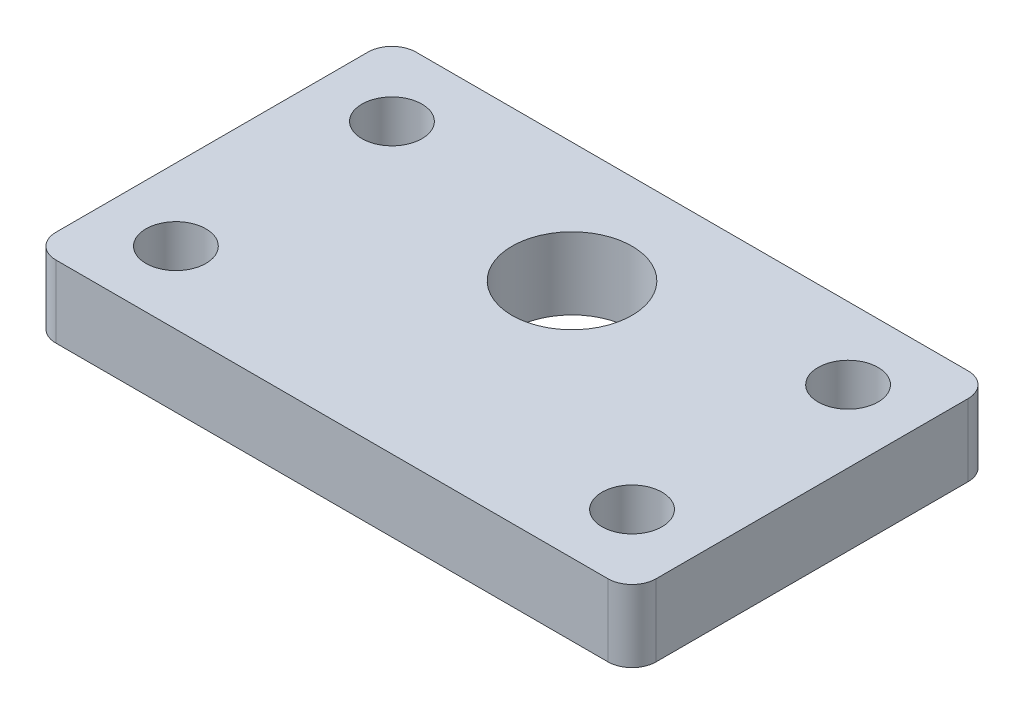
ISO-10303-21;
HEADER;
FILE_DESCRIPTION(('STEP AP214'),'2;1');
FILE_NAME('part.step','',(''),(''),'','','');
FILE_SCHEMA(('AUTOMOTIVE_DESIGN { 1 0 10303 214 1 1 1 1 }'));
ENDSEC;
DATA;
#1=APPLICATION_CONTEXT('core data for automotive mechanical design processes');
#2=APPLICATION_PROTOCOL_DEFINITION('international standard','automotive_design',2000,#1);
#3=PRODUCT_CONTEXT('',#1,'mechanical');
#4=PRODUCT('Part','Part','',(#3));
#5=PRODUCT_RELATED_PRODUCT_CATEGORY('part','',(#4));
#6=PRODUCT_DEFINITION_FORMATION('','',#4);
#7=PRODUCT_DEFINITION_CONTEXT('part definition',#1,'design');
#8=PRODUCT_DEFINITION('design','',#6,#7);
#9=PRODUCT_DEFINITION_SHAPE('','',#8);
#10=(LENGTH_UNIT() NAMED_UNIT(*) SI_UNIT(.MILLI.,.METRE.));
#11=(NAMED_UNIT(*) PLANE_ANGLE_UNIT() SI_UNIT($,.RADIAN.));
#12=(NAMED_UNIT(*) SI_UNIT($,.STERADIAN.) SOLID_ANGLE_UNIT());
#13=UNCERTAINTY_MEASURE_WITH_UNIT(LENGTH_MEASURE(1.E-05),#10,'distance_accuracy_value','');
#14=(GEOMETRIC_REPRESENTATION_CONTEXT(3) GLOBAL_UNCERTAINTY_ASSIGNED_CONTEXT((#13)) GLOBAL_UNIT_ASSIGNED_CONTEXT((#10,
#11,#12)) REPRESENTATION_CONTEXT('',''));
#15=CARTESIAN_POINT('',(0.,0.,0.));
#16=DIRECTION('',(0.,0.,1.));
#17=DIRECTION('',(1.,0.,0.));
#18=AXIS2_PLACEMENT_3D('',#15,#16,#17);
#19=CARTESIAN_POINT('',(-115.,30.,65.));
#20=DIRECTION('',(0.,-1.,0.));
#21=DIRECTION('',(0.,0.,-1.));
#22=AXIS2_PLACEMENT_3D('',#19,#20,#21);
#23=CYLINDRICAL_SURFACE('',#22,10.);
#24=CARTESIAN_POINT('',(-115.,0.,65.));
#25=DIRECTION('',(0.,1.,0.));
#26=DIRECTION('',(0.,0.,-1.));
#27=AXIS2_PLACEMENT_3D('',#24,#25,#26);
#28=CIRCLE('',#27,10.);
#29=CARTESIAN_POINT('',(-125.,0.,64.9999999999999));
#30=VERTEX_POINT('',#29);
#31=CARTESIAN_POINT('',(-115.,0.,75.));
#32=VERTEX_POINT('',#31);
#33=EDGE_CURVE('E129',#30,#32,#28,.T.);
#34=ORIENTED_EDGE('',*,*,#33,.T.);
#35=DIRECTION('',(0.,-1.,0.));
#36=VECTOR('',#35,1.);
#37=CARTESIAN_POINT('',(-115.,30.,75.));
#38=LINE('',#37,#36);
#39=CARTESIAN_POINT('',(-115.,30.,75.));
#40=VERTEX_POINT('',#39);
#41=EDGE_CURVE('E11',#40,#32,#38,.T.);
#42=ORIENTED_EDGE('',*,*,#41,.F.);
#43=CARTESIAN_POINT('',(-115.,30.,65.));
#44=DIRECTION('',(0.,1.,0.));
#45=DIRECTION('',(0.,0.,-1.));
#46=AXIS2_PLACEMENT_3D('',#43,#44,#45);
#47=CIRCLE('',#46,10.);
#48=CARTESIAN_POINT('',(-125.,30.,64.9999999999999));
#49=VERTEX_POINT('',#48);
#50=EDGE_CURVE('E144',#49,#40,#47,.T.);
#51=ORIENTED_EDGE('',*,*,#50,.F.);
#52=DIRECTION('',(0.,-1.,0.));
#53=VECTOR('',#52,1.);
#54=CARTESIAN_POINT('',(-125.,30.,64.9999999999999));
#55=LINE('',#54,#53);
#56=EDGE_CURVE('E125',#49,#30,#55,.T.);
#57=ORIENTED_EDGE('',*,*,#56,.T.);
#58=EDGE_LOOP('',(#34,#42,#51,#57));
#59=FACE_BOUND('',#58,.T.);
#60=ADVANCED_FACE('F33',(#59),#23,.T.);
#61=CARTESIAN_POINT('',(115.,30.,75.));
#62=DIRECTION('',(0.,0.,-1.));
#63=DIRECTION('',(-1.,0.,0.));
#64=AXIS2_PLACEMENT_3D('',#61,#62,#63);
#65=PLANE('',#64);
#66=DIRECTION('',(1.,0.,0.));
#67=VECTOR('',#66,1.);
#68=CARTESIAN_POINT('',(115.,0.,75.));
#69=LINE('',#68,#67);
#70=CARTESIAN_POINT('',(115.,0.,75.));
#71=VERTEX_POINT('',#70);
#72=EDGE_CURVE('E132',#32,#71,#69,.T.);
#73=ORIENTED_EDGE('',*,*,#72,.T.);
#74=DIRECTION('',(0.,-1.,0.));
#75=VECTOR('',#74,1.);
#76=CARTESIAN_POINT('',(115.,30.,75.));
#77=LINE('',#76,#75);
#78=CARTESIAN_POINT('',(115.,30.,75.));
#79=VERTEX_POINT('',#78);
#80=EDGE_CURVE('E41',#79,#71,#77,.T.);
#81=ORIENTED_EDGE('',*,*,#80,.F.);
#82=DIRECTION('',(1.,0.,0.));
#83=VECTOR('',#82,1.);
#84=CARTESIAN_POINT('',(115.,30.,75.));
#85=LINE('',#84,#83);
#86=EDGE_CURVE('E92',#40,#79,#85,.T.);
#87=ORIENTED_EDGE('',*,*,#86,.F.);
#88=ORIENTED_EDGE('',*,*,#41,.T.);
#89=EDGE_LOOP('',(#73,#81,#87,#88));
#90=FACE_BOUND('',#89,.T.);
#91=ADVANCED_FACE('F243',(#90),#65,.F.);
#92=CARTESIAN_POINT('',(115.,30.,65.));
#93=DIRECTION('',(0.,-1.,0.));
#94=DIRECTION('',(0.,0.,-1.));
#95=AXIS2_PLACEMENT_3D('',#92,#93,#94);
#96=CYLINDRICAL_SURFACE('',#95,9.99999999999999);
#97=CARTESIAN_POINT('',(115.,0.,65.));
#98=DIRECTION('',(0.,1.,0.));
#99=DIRECTION('',(0.,0.,1.));
#100=AXIS2_PLACEMENT_3D('',#97,#98,#99);
#101=CIRCLE('',#100,9.99999999999999);
#102=CARTESIAN_POINT('',(125.,0.,64.9999999999999));
#103=VERTEX_POINT('',#102);
#104=EDGE_CURVE('E135',#71,#103,#101,.T.);
#105=ORIENTED_EDGE('',*,*,#104,.T.);
#106=DIRECTION('',(0.,-1.,0.));
#107=VECTOR('',#106,1.);
#108=CARTESIAN_POINT('',(125.,30.,64.9999999999999));
#109=LINE('',#108,#107);
#110=CARTESIAN_POINT('',(125.,30.,64.9999999999999));
#111=VERTEX_POINT('',#110);
#112=EDGE_CURVE('E151',#111,#103,#109,.T.);
#113=ORIENTED_EDGE('',*,*,#112,.F.);
#114=CARTESIAN_POINT('',(115.,30.,65.));
#115=DIRECTION('',(0.,1.,0.));
#116=DIRECTION('',(0.,0.,1.));
#117=AXIS2_PLACEMENT_3D('',#114,#115,#116);
#118=CIRCLE('',#117,9.99999999999999);
#119=EDGE_CURVE('E159',#79,#111,#118,.T.);
#120=ORIENTED_EDGE('',*,*,#119,.F.);
#121=ORIENTED_EDGE('',*,*,#80,.T.);
#122=EDGE_LOOP('',(#105,#113,#120,#121));
#123=FACE_BOUND('',#122,.T.);
#124=ADVANCED_FACE('F157',(#123),#96,.T.);
#125=CARTESIAN_POINT('',(125.,30.,64.9999999999999));
#126=DIRECTION('',(-1.,0.,0.));
#127=DIRECTION('',(0.,0.,1.));
#128=AXIS2_PLACEMENT_3D('',#125,#126,#127);
#129=PLANE('',#128);
#130=DIRECTION('',(0.,0.,-1.));
#131=VECTOR('',#130,1.);
#132=CARTESIAN_POINT('',(125.,0.,64.9999999999999));
#133=LINE('',#132,#131);
#134=CARTESIAN_POINT('',(125.,0.,-64.9999999999999));
#135=VERTEX_POINT('',#134);
#136=EDGE_CURVE('E137',#103,#135,#133,.T.);
#137=ORIENTED_EDGE('',*,*,#136,.T.);
#138=DIRECTION('',(0.,-1.,0.));
#139=VECTOR('',#138,1.);
#140=CARTESIAN_POINT('',(125.,30.,-64.9999999999999));
#141=LINE('',#140,#139);
#142=CARTESIAN_POINT('',(125.,30.,-64.9999999999999));
#143=VERTEX_POINT('',#142);
#144=EDGE_CURVE('E148',#143,#135,#141,.T.);
#145=ORIENTED_EDGE('',*,*,#144,.F.);
#146=DIRECTION('',(0.,0.,-1.));
#147=VECTOR('',#146,1.);
#148=CARTESIAN_POINT('',(125.,30.,64.9999999999999));
#149=LINE('',#148,#147);
#150=EDGE_CURVE('E171',#111,#143,#149,.T.);
#151=ORIENTED_EDGE('',*,*,#150,.F.);
#152=ORIENTED_EDGE('',*,*,#112,.T.);
#153=EDGE_LOOP('',(#137,#145,#151,#152));
#154=FACE_BOUND('',#153,.T.);
#155=ADVANCED_FACE('F167',(#154),#129,.F.);
#156=CARTESIAN_POINT('',(115.,30.,-65.));
#157=DIRECTION('',(0.,-1.,0.));
#158=DIRECTION('',(0.,0.,-1.));
#159=AXIS2_PLACEMENT_3D('',#156,#157,#158);
#160=CYLINDRICAL_SURFACE('',#159,9.99999999999999);
#161=CARTESIAN_POINT('',(115.,0.,-65.));
#162=DIRECTION('',(0.,1.,0.));
#163=DIRECTION('',(0.,0.,1.));
#164=AXIS2_PLACEMENT_3D('',#161,#162,#163);
#165=CIRCLE('',#164,9.99999999999999);
#166=CARTESIAN_POINT('',(115.,0.,-75.));
#167=VERTEX_POINT('',#166);
#168=EDGE_CURVE('E139',#135,#167,#165,.T.);
#169=ORIENTED_EDGE('',*,*,#168,.T.);
#170=DIRECTION('',(0.,-1.,0.));
#171=VECTOR('',#170,1.);
#172=CARTESIAN_POINT('',(115.,30.,-75.));
#173=LINE('',#172,#171);
#174=CARTESIAN_POINT('',(115.,30.,-75.));
#175=VERTEX_POINT('',#174);
#176=EDGE_CURVE('E120',#175,#167,#173,.T.);
#177=ORIENTED_EDGE('',*,*,#176,.F.);
#178=CARTESIAN_POINT('',(115.,30.,-65.));
#179=DIRECTION('',(0.,1.,0.));
#180=DIRECTION('',(0.,0.,1.));
#181=AXIS2_PLACEMENT_3D('',#178,#179,#180);
#182=CIRCLE('',#181,9.99999999999999);
#183=EDGE_CURVE('E111',#143,#175,#182,.T.);
#184=ORIENTED_EDGE('',*,*,#183,.F.);
#185=ORIENTED_EDGE('',*,*,#144,.T.);
#186=EDGE_LOOP('',(#169,#177,#184,#185));
#187=FACE_BOUND('',#186,.T.);
#188=ADVANCED_FACE('F170',(#187),#160,.T.);
#189=CARTESIAN_POINT('',(115.,30.,-75.));
#190=DIRECTION('',(0.,0.,1.));
#191=DIRECTION('',(1.,0.,0.));
#192=AXIS2_PLACEMENT_3D('',#189,#190,#191);
#193=PLANE('',#192);
#194=DIRECTION('',(-1.,0.,0.));
#195=VECTOR('',#194,1.);
#196=CARTESIAN_POINT('',(115.,0.,-75.));
#197=LINE('',#196,#195);
#198=CARTESIAN_POINT('',(-115.,0.,-75.));
#199=VERTEX_POINT('',#198);
#200=EDGE_CURVE('E119',#167,#199,#197,.T.);
#201=ORIENTED_EDGE('',*,*,#200,.T.);
#202=DIRECTION('',(0.,-1.,0.));
#203=VECTOR('',#202,1.);
#204=CARTESIAN_POINT('',(-115.,30.,-75.));
#205=LINE('',#204,#203);
#206=CARTESIAN_POINT('',(-115.,30.,-75.));
#207=VERTEX_POINT('',#206);
#208=EDGE_CURVE('E116',#207,#199,#205,.T.);
#209=ORIENTED_EDGE('',*,*,#208,.F.);
#210=DIRECTION('',(-1.,0.,0.));
#211=VECTOR('',#210,1.);
#212=CARTESIAN_POINT('',(115.,30.,-75.));
#213=LINE('',#212,#211);
#214=EDGE_CURVE('E105',#175,#207,#213,.T.);
#215=ORIENTED_EDGE('',*,*,#214,.F.);
#216=ORIENTED_EDGE('',*,*,#176,.T.);
#217=EDGE_LOOP('',(#201,#209,#215,#216));
#218=FACE_BOUND('',#217,.T.);
#219=ADVANCED_FACE('F117',(#218),#193,.F.);
#220=CARTESIAN_POINT('',(-115.,30.,-65.));
#221=DIRECTION('',(0.,-1.,0.));
#222=DIRECTION('',(0.,0.,-1.));
#223=AXIS2_PLACEMENT_3D('',#220,#221,#222);
#224=CYLINDRICAL_SURFACE('',#223,10.);
#225=CARTESIAN_POINT('',(-115.,0.,-65.));
#226=DIRECTION('',(0.,1.,0.));
#227=DIRECTION('',(0.,0.,1.));
#228=AXIS2_PLACEMENT_3D('',#225,#226,#227);
#229=CIRCLE('',#228,10.);
#230=CARTESIAN_POINT('',(-125.,0.,-64.9999999999999));
#231=VERTEX_POINT('',#230);
#232=EDGE_CURVE('E78',#199,#231,#229,.T.);
#233=ORIENTED_EDGE('',*,*,#232,.T.);
#234=DIRECTION('',(0.,-1.,0.));
#235=VECTOR('',#234,1.);
#236=CARTESIAN_POINT('',(-125.,30.,-64.9999999999999));
#237=LINE('',#236,#235);
#238=CARTESIAN_POINT('',(-125.,30.,-64.9999999999999));
#239=VERTEX_POINT('',#238);
#240=EDGE_CURVE('E121',#239,#231,#237,.T.);
#241=ORIENTED_EDGE('',*,*,#240,.F.);
#242=CARTESIAN_POINT('',(-115.,30.,-65.));
#243=DIRECTION('',(0.,1.,0.));
#244=DIRECTION('',(0.,0.,1.));
#245=AXIS2_PLACEMENT_3D('',#242,#243,#244);
#246=CIRCLE('',#245,10.);
#247=EDGE_CURVE('E109',#207,#239,#246,.T.);
#248=ORIENTED_EDGE('',*,*,#247,.F.);
#249=ORIENTED_EDGE('',*,*,#208,.T.);
#250=EDGE_LOOP('',(#233,#241,#248,#249));
#251=FACE_BOUND('',#250,.T.);
#252=ADVANCED_FACE('F123',(#251),#224,.T.);
#253=CARTESIAN_POINT('',(-125.,30.,64.9999999999999));
#254=DIRECTION('',(1.,0.,0.));
#255=DIRECTION('',(0.,0.,-1.));
#256=AXIS2_PLACEMENT_3D('',#253,#254,#255);
#257=PLANE('',#256);
#258=DIRECTION('',(0.,0.,1.));
#259=VECTOR('',#258,1.);
#260=CARTESIAN_POINT('',(-125.,0.,64.9999999999999));
#261=LINE('',#260,#259);
#262=EDGE_CURVE('E84',#231,#30,#261,.T.);
#263=ORIENTED_EDGE('',*,*,#262,.T.);
#264=ORIENTED_EDGE('',*,*,#56,.F.);
#265=DIRECTION('',(0.,0.,1.));
#266=VECTOR('',#265,1.);
#267=CARTESIAN_POINT('',(-125.,30.,64.9999999999999));
#268=LINE('',#267,#266);
#269=EDGE_CURVE('E49',#239,#49,#268,.T.);
#270=ORIENTED_EDGE('',*,*,#269,.F.);
#271=ORIENTED_EDGE('',*,*,#240,.T.);
#272=EDGE_LOOP('',(#263,#264,#270,#271));
#273=FACE_BOUND('',#272,.T.);
#274=ADVANCED_FACE('F218',(#273),#257,.F.);
#275=CARTESIAN_POINT('',(-115.,30.,65.));
#276=DIRECTION('',(0.,-1.,0.));
#277=DIRECTION('',(0.,0.,-1.));
#278=AXIS2_PLACEMENT_3D('',#275,#276,#277);
#279=PLANE('',#278);
#280=CARTESIAN_POINT('',(95.,30.,45.));
#281=DIRECTION('',(0.,1.,0.));
#282=DIRECTION('',(0.,0.,1.));
#283=AXIS2_PLACEMENT_3D('',#280,#281,#282);
#284=CIRCLE('',#283,12.5);
#285=CARTESIAN_POINT('',(95.,30.,57.5));
#286=VERTEX_POINT('',#285);
#287=EDGE_CURVE('E201',#286,#286,#284,.T.);
#288=ORIENTED_EDGE('',*,*,#287,.F.);
#289=EDGE_LOOP('',(#288));
#290=FACE_BOUND('',#289,.T.);
#291=CARTESIAN_POINT('',(-95.,30.,45.));
#292=DIRECTION('',(0.,1.,0.));
#293=DIRECTION('',(0.,0.,1.));
#294=AXIS2_PLACEMENT_3D('',#291,#292,#293);
#295=CIRCLE('',#294,12.5);
#296=CARTESIAN_POINT('',(-95.,30.,57.5));
#297=VERTEX_POINT('',#296);
#298=EDGE_CURVE('E195',#297,#297,#295,.T.);
#299=ORIENTED_EDGE('',*,*,#298,.F.);
#300=EDGE_LOOP('',(#299));
#301=FACE_BOUND('',#300,.T.);
#302=CARTESIAN_POINT('',(95.,30.,-45.));
#303=DIRECTION('',(0.,1.,0.));
#304=DIRECTION('',(0.,0.,1.));
#305=AXIS2_PLACEMENT_3D('',#302,#303,#304);
#306=CIRCLE('',#305,12.5);
#307=CARTESIAN_POINT('',(95.,30.,-32.5));
#308=VERTEX_POINT('',#307);
#309=EDGE_CURVE('E189',#308,#308,#306,.T.);
#310=ORIENTED_EDGE('',*,*,#309,.F.);
#311=EDGE_LOOP('',(#310));
#312=FACE_BOUND('',#311,.T.);
#313=CARTESIAN_POINT('',(-95.,30.,-45.));
#314=DIRECTION('',(0.,1.,0.));
#315=DIRECTION('',(0.,0.,1.));
#316=AXIS2_PLACEMENT_3D('',#313,#314,#315);
#317=CIRCLE('',#316,12.5);
#318=CARTESIAN_POINT('',(-95.,30.,-32.5));
#319=VERTEX_POINT('',#318);
#320=EDGE_CURVE('E183',#319,#319,#317,.T.);
#321=ORIENTED_EDGE('',*,*,#320,.F.);
#322=EDGE_LOOP('',(#321));
#323=FACE_BOUND('',#322,.T.);
#324=CARTESIAN_POINT('',(0.,30.,-25.));
#325=DIRECTION('',(0.,1.,0.));
#326=DIRECTION('',(0.,0.,1.));
#327=AXIS2_PLACEMENT_3D('',#324,#325,#326);
#328=CIRCLE('',#327,25.);
#329=CARTESIAN_POINT('',(0.,30.,0.));
#330=VERTEX_POINT('',#329);
#331=EDGE_CURVE('E177',#330,#330,#328,.T.);
#332=ORIENTED_EDGE('',*,*,#331,.F.);
#333=EDGE_LOOP('',(#332));
#334=FACE_BOUND('',#333,.T.);
#335=ORIENTED_EDGE('',*,*,#50,.T.);
#336=ORIENTED_EDGE('',*,*,#86,.T.);
#337=ORIENTED_EDGE('',*,*,#119,.T.);
#338=ORIENTED_EDGE('',*,*,#150,.T.);
#339=ORIENTED_EDGE('',*,*,#183,.T.);
#340=ORIENTED_EDGE('',*,*,#214,.T.);
#341=ORIENTED_EDGE('',*,*,#247,.T.);
#342=ORIENTED_EDGE('',*,*,#269,.T.);
#343=EDGE_LOOP('',(#335,#336,#337,#338,#339,#340,#341,#342));
#344=FACE_BOUND('',#343,.T.);
#345=ADVANCED_FACE('F107',(#290,#301,#312,#323,#334,#344),#279,.F.);
#346=CARTESIAN_POINT('',(-115.,0.,65.));
#347=DIRECTION('',(0.,-1.,0.));
#348=DIRECTION('',(0.,0.,-1.));
#349=AXIS2_PLACEMENT_3D('',#346,#347,#348);
#350=PLANE('',#349);
#351=CARTESIAN_POINT('',(95.,0.,45.));
#352=DIRECTION('',(0.,1.,0.));
#353=DIRECTION('',(0.,0.,1.));
#354=AXIS2_PLACEMENT_3D('',#351,#352,#353);
#355=CIRCLE('',#354,12.5);
#356=CARTESIAN_POINT('',(95.,0.,57.5));
#357=VERTEX_POINT('',#356);
#358=EDGE_CURVE('E198',#357,#357,#355,.T.);
#359=ORIENTED_EDGE('',*,*,#358,.T.);
#360=EDGE_LOOP('',(#359));
#361=FACE_BOUND('',#360,.T.);
#362=CARTESIAN_POINT('',(-95.,0.,45.));
#363=DIRECTION('',(0.,1.,0.));
#364=DIRECTION('',(0.,0.,1.));
#365=AXIS2_PLACEMENT_3D('',#362,#363,#364);
#366=CIRCLE('',#365,12.5);
#367=CARTESIAN_POINT('',(-95.,0.,57.5));
#368=VERTEX_POINT('',#367);
#369=EDGE_CURVE('E192',#368,#368,#366,.T.);
#370=ORIENTED_EDGE('',*,*,#369,.T.);
#371=EDGE_LOOP('',(#370));
#372=FACE_BOUND('',#371,.T.);
#373=CARTESIAN_POINT('',(95.,0.,-45.));
#374=DIRECTION('',(0.,1.,0.));
#375=DIRECTION('',(0.,0.,1.));
#376=AXIS2_PLACEMENT_3D('',#373,#374,#375);
#377=CIRCLE('',#376,12.5);
#378=CARTESIAN_POINT('',(95.,0.,-32.5));
#379=VERTEX_POINT('',#378);
#380=EDGE_CURVE('E186',#379,#379,#377,.T.);
#381=ORIENTED_EDGE('',*,*,#380,.T.);
#382=EDGE_LOOP('',(#381));
#383=FACE_BOUND('',#382,.T.);
#384=CARTESIAN_POINT('',(-95.,0.,-45.));
#385=DIRECTION('',(0.,1.,0.));
#386=DIRECTION('',(0.,0.,1.));
#387=AXIS2_PLACEMENT_3D('',#384,#385,#386);
#388=CIRCLE('',#387,12.5);
#389=CARTESIAN_POINT('',(-95.,0.,-32.5));
#390=VERTEX_POINT('',#389);
#391=EDGE_CURVE('E180',#390,#390,#388,.T.);
#392=ORIENTED_EDGE('',*,*,#391,.T.);
#393=EDGE_LOOP('',(#392));
#394=FACE_BOUND('',#393,.T.);
#395=CARTESIAN_POINT('',(0.,0.,-25.));
#396=DIRECTION('',(0.,1.,0.));
#397=DIRECTION('',(0.,0.,1.));
#398=AXIS2_PLACEMENT_3D('',#395,#396,#397);
#399=CIRCLE('',#398,25.);
#400=CARTESIAN_POINT('',(0.,0.,0.));
#401=VERTEX_POINT('',#400);
#402=EDGE_CURVE('E133',#401,#401,#399,.T.);
#403=ORIENTED_EDGE('',*,*,#402,.T.);
#404=EDGE_LOOP('',(#403));
#405=FACE_BOUND('',#404,.T.);
#406=ORIENTED_EDGE('',*,*,#33,.F.);
#407=ORIENTED_EDGE('',*,*,#262,.F.);
#408=ORIENTED_EDGE('',*,*,#232,.F.);
#409=ORIENTED_EDGE('',*,*,#200,.F.);
#410=ORIENTED_EDGE('',*,*,#168,.F.);
#411=ORIENTED_EDGE('',*,*,#136,.F.);
#412=ORIENTED_EDGE('',*,*,#104,.F.);
#413=ORIENTED_EDGE('',*,*,#72,.F.);
#414=EDGE_LOOP('',(#406,#407,#408,#409,#410,#411,#412,#413));
#415=FACE_BOUND('',#414,.T.);
#416=ADVANCED_FACE('F163',(#361,#372,#383,#394,#405,#415),#350,.T.);
#417=CARTESIAN_POINT('',(0.,0.,-25.));
#418=DIRECTION('',(0.,1.,0.));
#419=DIRECTION('',(0.,0.,1.));
#420=AXIS2_PLACEMENT_3D('',#417,#418,#419);
#421=CYLINDRICAL_SURFACE('',#420,25.);
#422=ORIENTED_EDGE('',*,*,#402,.F.);
#423=EDGE_LOOP('',(#422));
#424=FACE_BOUND('',#423,.T.);
#425=ORIENTED_EDGE('',*,*,#331,.T.);
#426=EDGE_LOOP('',(#425));
#427=FACE_BOUND('',#426,.T.);
#428=ADVANCED_FACE('F228',(#424,#427),#421,.F.);
#429=CARTESIAN_POINT('',(-95.,0.,-45.));
#430=DIRECTION('',(0.,1.,0.));
#431=DIRECTION('',(0.,0.,1.));
#432=AXIS2_PLACEMENT_3D('',#429,#430,#431);
#433=CYLINDRICAL_SURFACE('',#432,12.5);
#434=ORIENTED_EDGE('',*,*,#391,.F.);
#435=EDGE_LOOP('',(#434));
#436=FACE_BOUND('',#435,.T.);
#437=ORIENTED_EDGE('',*,*,#320,.T.);
#438=EDGE_LOOP('',(#437));
#439=FACE_BOUND('',#438,.T.);
#440=ADVANCED_FACE('F230',(#436,#439),#433,.F.);
#441=CARTESIAN_POINT('',(95.,0.,-45.));
#442=DIRECTION('',(0.,1.,0.));
#443=DIRECTION('',(0.,0.,1.));
#444=AXIS2_PLACEMENT_3D('',#441,#442,#443);
#445=CYLINDRICAL_SURFACE('',#444,12.5);
#446=ORIENTED_EDGE('',*,*,#380,.F.);
#447=EDGE_LOOP('',(#446));
#448=FACE_BOUND('',#447,.T.);
#449=ORIENTED_EDGE('',*,*,#309,.T.);
#450=EDGE_LOOP('',(#449));
#451=FACE_BOUND('',#450,.T.);
#452=ADVANCED_FACE('F237',(#448,#451),#445,.F.);
#453=CARTESIAN_POINT('',(-95.,0.,45.));
#454=DIRECTION('',(0.,1.,0.));
#455=DIRECTION('',(0.,0.,1.));
#456=AXIS2_PLACEMENT_3D('',#453,#454,#455);
#457=CYLINDRICAL_SURFACE('',#456,12.5);
#458=ORIENTED_EDGE('',*,*,#369,.F.);
#459=EDGE_LOOP('',(#458));
#460=FACE_BOUND('',#459,.T.);
#461=ORIENTED_EDGE('',*,*,#298,.T.);
#462=EDGE_LOOP('',(#461));
#463=FACE_BOUND('',#462,.T.);
#464=ADVANCED_FACE('F212',(#460,#463),#457,.F.);
#465=CARTESIAN_POINT('',(95.,0.,45.));
#466=DIRECTION('',(0.,1.,0.));
#467=DIRECTION('',(0.,0.,1.));
#468=AXIS2_PLACEMENT_3D('',#465,#466,#467);
#469=CYLINDRICAL_SURFACE('',#468,12.5);
#470=ORIENTED_EDGE('',*,*,#358,.F.);
#471=EDGE_LOOP('',(#470));
#472=FACE_BOUND('',#471,.T.);
#473=ORIENTED_EDGE('',*,*,#287,.T.);
#474=EDGE_LOOP('',(#473));
#475=FACE_BOUND('',#474,.T.);
#476=ADVANCED_FACE('F209',(#472,#475),#469,.F.);
#477=CLOSED_SHELL('',(#60,#91,#124,#155,#188,#219,#252,#274,#345,#416,#428,#440,#452,#464,#476));
#478=MANIFOLD_SOLID_BREP('B2',#477);
#479=ADVANCED_BREP_SHAPE_REPRESENTATION('',(#18,#478),#14);
#480=SHAPE_DEFINITION_REPRESENTATION(#9,#479);
ENDSEC;
END-ISO-10303-21;
